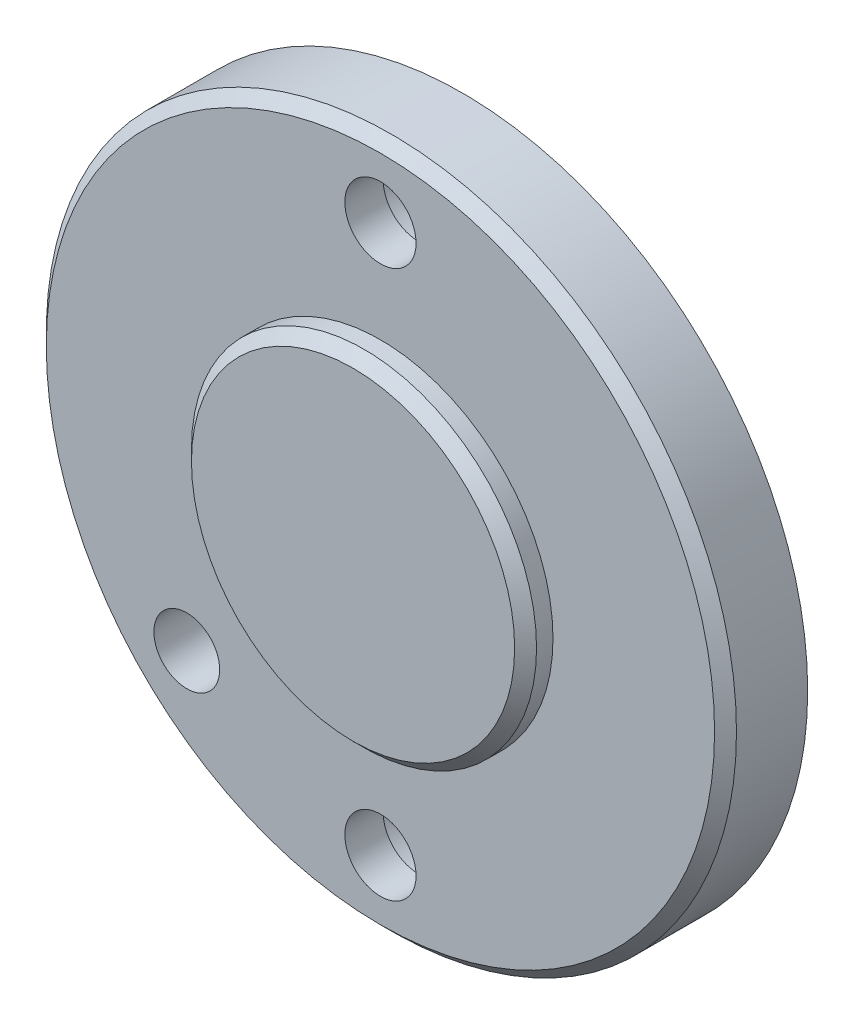
ISO-10303-21;
HEADER;
FILE_DESCRIPTION(('STEP AP214'),'2;1');
FILE_NAME('part.step','',(''),(''),'','','');
FILE_SCHEMA(('AUTOMOTIVE_DESIGN { 1 0 10303 214 1 1 1 1 }'));
ENDSEC;
DATA;
#1=APPLICATION_CONTEXT('core data for automotive mechanical design processes');
#2=APPLICATION_PROTOCOL_DEFINITION('international standard','automotive_design',2000,#1);
#3=PRODUCT_CONTEXT('',#1,'mechanical');
#4=PRODUCT('Part','Part','',(#3));
#5=PRODUCT_RELATED_PRODUCT_CATEGORY('part','',(#4));
#6=PRODUCT_DEFINITION_FORMATION('','',#4);
#7=PRODUCT_DEFINITION_CONTEXT('part definition',#1,'design');
#8=PRODUCT_DEFINITION('design','',#6,#7);
#9=PRODUCT_DEFINITION_SHAPE('','',#8);
#10=(LENGTH_UNIT() NAMED_UNIT(*) SI_UNIT(.MILLI.,.METRE.));
#11=(NAMED_UNIT(*) PLANE_ANGLE_UNIT() SI_UNIT($,.RADIAN.));
#12=(NAMED_UNIT(*) SI_UNIT($,.STERADIAN.) SOLID_ANGLE_UNIT());
#13=UNCERTAINTY_MEASURE_WITH_UNIT(LENGTH_MEASURE(1.E-05),#10,'distance_accuracy_value','');
#14=(GEOMETRIC_REPRESENTATION_CONTEXT(3) GLOBAL_UNCERTAINTY_ASSIGNED_CONTEXT((#13)) GLOBAL_UNIT_ASSIGNED_CONTEXT((#10,
#11,#12)) REPRESENTATION_CONTEXT('',''));
#15=CARTESIAN_POINT('',(0.,0.,0.));
#16=DIRECTION('',(0.,0.,1.));
#17=DIRECTION('',(1.,0.,0.));
#18=AXIS2_PLACEMENT_3D('',#15,#16,#17);
#19=CARTESIAN_POINT('',(0.,0.,-5.));
#20=DIRECTION('',(0.,0.,1.));
#21=DIRECTION('',(1.,0.,0.));
#22=AXIS2_PLACEMENT_3D('',#19,#20,#21);
#23=CYLINDRICAL_SURFACE('',#22,15.75);
#24=CARTESIAN_POINT('',(0.,0.,-5.));
#25=DIRECTION('',(0.,0.,-1.));
#26=DIRECTION('',(-1.,0.,0.));
#27=AXIS2_PLACEMENT_3D('',#24,#25,#26);
#28=CIRCLE('',#27,15.75);
#29=CARTESIAN_POINT('',(-15.75,0.,-5.));
#30=VERTEX_POINT('',#29);
#31=EDGE_CURVE('E76',#30,#30,#28,.T.);
#32=ORIENTED_EDGE('',*,*,#31,.F.);
#33=EDGE_LOOP('',(#32));
#34=FACE_BOUND('',#33,.T.);
#35=CARTESIAN_POINT('',(0.,0.,0.));
#36=DIRECTION('',(0.,0.,1.));
#37=DIRECTION('',(1.,0.,0.));
#38=AXIS2_PLACEMENT_3D('',#35,#36,#37);
#39=CIRCLE('',#38,15.75);
#40=CARTESIAN_POINT('',(15.75,0.,0.));
#41=VERTEX_POINT('',#40);
#42=EDGE_CURVE('E63',#41,#41,#39,.F.);
#43=ORIENTED_EDGE('',*,*,#42,.T.);
#44=EDGE_LOOP('',(#43));
#45=FACE_BOUND('',#44,.T.);
#46=CARTESIAN_POINT('',(0.,15.75,-1.025));
#47=CARTESIAN_POINT('',(0.0826571483601052,15.7499991035098,-1.02500359229986));
#48=CARTESIAN_POINT('',(0.165369597997333,15.7493423907079,-1.03197138826837));
#49=CARTESIAN_POINT('',(0.328503246111101,15.7467857785823,-1.05966315356933));
#50=CARTESIAN_POINT('',(0.408921787236413,15.7448844940345,-1.08040245112928));
#51=CARTESIAN_POINT('',(0.565081525382566,15.7400534533045,-1.13502979919192));
#52=CARTESIAN_POINT('',(0.640825445362738,15.7371243026301,-1.16891010966262));
#53=CARTESIAN_POINT('',(0.785534239159598,15.7305654449096,-1.2488431844416));
#54=CARTESIAN_POINT('',(0.854500497986787,15.7269358814436,-1.29489345470144));
#55=CARTESIAN_POINT('',(0.983932531511118,15.7193701666557,-1.39801659297456));
#56=CARTESIAN_POINT('',(1.0443737704595,15.7154331791069,-1.45512019779767));
#57=CARTESIAN_POINT('',(1.154829310124,15.7077032941751,-1.57866368733053));
#58=CARTESIAN_POINT('',(1.20484313850169,15.7039104033256,-1.64510399474396));
#59=CARTESIAN_POINT('',(1.29310965803656,15.6968894568813,-1.7855866512119));
#60=CARTESIAN_POINT('',(1.33134037911943,15.6936624611898,-1.85964286177298));
#61=CARTESIAN_POINT('',(1.39481515219401,15.6881487680452,-2.01315883308938));
#62=CARTESIAN_POINT('',(1.42005948809152,15.6858620500361,-2.09261847567292));
#63=CARTESIAN_POINT('',(1.45677272439157,15.6824951974023,-2.25443705390308));
#64=CARTESIAN_POINT('',(1.46828206525329,15.6814115212769,-2.33678673954796));
#65=CARTESIAN_POINT('',(1.47732358226487,15.6805623863445,-2.50225559731477));
#66=CARTESIAN_POINT('',(1.47485608345999,15.6807968968817,-2.58537475149706));
#67=CARTESIAN_POINT('',(1.45604733140997,15.6825544098289,-2.74974498830716));
#68=CARTESIAN_POINT('',(1.4397501507136,15.6840733190519,-2.83100116402483));
#69=CARTESIAN_POINT('',(1.39381318594161,15.6882220835359,-2.98961983081341));
#70=CARTESIAN_POINT('',(1.36417324162903,15.6908519521388,-3.06698227511102));
#71=CARTESIAN_POINT('',(1.29234319062757,15.6969310283115,-3.2157571615657));
#72=CARTESIAN_POINT('',(1.25013344207836,15.7003815164881,-3.28716006597813));
#73=CARTESIAN_POINT('',(1.15437609400503,15.7077119292549,-3.42188466453748));
#74=CARTESIAN_POINT('',(1.10082820371016,15.7115918648572,-3.48520615136676));
#75=CARTESIAN_POINT('',(0.983668028070629,15.7193622321385,-3.60222661637762));
#76=CARTESIAN_POINT('',(0.920017664842107,15.723252646468,-3.65588747975337));
#77=CARTESIAN_POINT('',(0.784591814362735,15.7305914195045,-3.75176833522627));
#78=CARTESIAN_POINT('',(0.712816319613766,15.7340397778034,-3.79398831676531));
#79=CARTESIAN_POINT('',(0.563151897609025,15.7401068366299,-3.86578707012577));
#80=CARTESIAN_POINT('',(0.485262084873731,15.7427254167108,-3.89536400696076));
#81=CARTESIAN_POINT('',(0.325592048775548,15.7468365931848,-3.94100965917805));
#82=CARTESIAN_POINT('',(0.243811927476125,15.7483292191003,-3.95707872873719));
#83=CARTESIAN_POINT('',(0.079012906161295,15.7500165189557,-3.97520437900412));
#84=CARTESIAN_POINT('',(-0.00400015901415968,15.7502160665629,-3.97731357571201));
#85=CARTESIAN_POINT('',(-0.169198642524293,15.7493077738885,-3.96759765811979));
#86=CARTESIAN_POINT('',(-0.251384070632599,15.7481999490641,-3.95577270856413));
#87=CARTESIAN_POINT('',(-0.41244321243018,15.7448045653492,-3.91856780006489));
#88=CARTESIAN_POINT('',(-0.491322642904664,15.7425191421983,-3.893212377573));
#89=CARTESIAN_POINT('',(-0.643708145014545,15.7370250907184,-3.82969142360863));
#90=CARTESIAN_POINT('',(-0.717214110277225,15.7338164441196,-3.79152563862674));
#91=CARTESIAN_POINT('',(-0.857004637045904,15.7268230188743,-3.70333616016027));
#92=CARTESIAN_POINT('',(-0.923267231658798,15.72303656681,-3.6532777814134));
#93=CARTESIAN_POINT('',(-1.04646795405064,15.7153180864231,-3.54277397075242));
#94=CARTESIAN_POINT('',(-1.10340587689154,15.7113860549033,-3.48232831060601));
#95=CARTESIAN_POINT('',(-1.2065228007326,15.7038050089881,-3.35253668999644));
#96=CARTESIAN_POINT('',(-1.25266734842523,15.7001569250497,-3.28316329509336));
#97=CARTESIAN_POINT('',(-1.33265104803968,15.6935706140081,-3.13762127299088));
#98=CARTESIAN_POINT('',(-1.36649035018899,15.690632378239,-3.06145272876358));
#99=CARTESIAN_POINT('',(-1.42084489925281,15.6858040381628,-2.90460225130565));
#100=CARTESIAN_POINT('',(-1.44138088316584,15.6839123032625,-2.82392755648324));
#101=CARTESIAN_POINT('',(-1.46861323381282,15.6813859457834,-2.66025653987748));
#102=CARTESIAN_POINT('',(-1.47530994444978,15.6807512919664,-2.57726027583658));
#103=CARTESIAN_POINT('',(-1.47466920747502,15.6808115359026,-2.41164449410185));
#104=CARTESIAN_POINT('',(-1.46738588525625,15.6815013059914,-2.32902475978614));
#105=CARTESIAN_POINT('',(-1.4391050646026,15.6841217608103,-2.16618780139515));
#106=CARTESIAN_POINT('',(-1.41810754835,15.6860524471525,-2.0859705804414));
#107=CARTESIAN_POINT('',(-1.36300883921194,15.6909358028365,-1.93021457984005));
#108=CARTESIAN_POINT('',(-1.32890899535255,15.6938883669618,-1.85467531947535));
#109=CARTESIAN_POINT('',(-1.24857933722215,15.7004830060454,-1.71038430007716));
#110=CARTESIAN_POINT('',(-1.20234963990488,15.7041250743555,-1.64163247560931));
#111=CARTESIAN_POINT('',(-1.09886909936237,15.711705207446,-1.51259061219349));
#112=CARTESIAN_POINT('',(-1.04157799434058,15.7156443204866,-1.45233292088949));
#113=CARTESIAN_POINT('',(-0.917678522322408,15.7233651088524,-1.3422614697405));
#114=CARTESIAN_POINT('',(-0.851067918012397,15.727146746089,-1.29245022495002));
#115=CARTESIAN_POINT('',(-0.710259293481323,15.7341351309695,-1.20460003816502));
#116=CARTESIAN_POINT('',(-0.636044535873988,15.7373405657305,-1.16658784082245));
#117=CARTESIAN_POINT('',(-0.48230439529333,15.7428007256491,-1.10361442053741));
#118=CARTESIAN_POINT('',(-0.402785163711928,15.7450565305927,-1.07863836692232));
#119=CARTESIAN_POINT('',(-0.269006675153423,15.7477914937434,-1.04872772354005));
#120=CARTESIAN_POINT('',(-0.2156047519297,15.7486158586512,-1.0398418508608));
#121=CARTESIAN_POINT('',(-0.108143109486163,15.7497204041159,-1.02797682421591));
#122=CARTESIAN_POINT('',(-0.0540833925753423,15.7500005865824,-1.02499764952255));
#123=CARTESIAN_POINT('',(0.,15.75,-1.025));
#124=B_SPLINE_CURVE_WITH_KNOTS('',3,(#46,#47,#48,#49,#50,#51,#52,#53,#54,#55,#56,#57,#58,#59,
#60,#61,#62,#63,#64,#65,#66,#67,#68,#69,#70,#71,#72,#73,#74,#75,#76,#77,#78,#79,#80,#81,#82,#83,
#84,#85,#86,#87,#88,#89,#90,#91,#92,#93,#94,#95,#96,#97,#98,#99,#100,#101,#102,#103,#104,#105,
#106,#107,#108,#109,#110,#111,#112,#113,#114,#115,#116,#117,#118,#119,#120,#121,#122,#123),
.UNSPECIFIED.,.T.,.F.,(4,2,2,2,2,2,2,2,2,2,2,2,2,2,2,2,2,2,2,2,2,2,2,2,2,2,2,2,2,2,2,2,2,2,2,2,
2,2,4),(0.,0.247773964473802,0.495824174499337,0.74372850473767,0.991582070092005,
1.2401350268247,1.48869924000682,1.73772414585759,1.98674360734368,2.23502804816671,
2.48330671491258,2.73079712362453,2.97829050459715,3.2261726719988,3.47406119719827,
3.72290726975589,3.97175357195808,4.22063597896605,4.46951186006317,4.71744916904945,
4.96538354668404,5.21286983508894,5.46036102138808,5.70858308473555,5.95681060278657,
6.20581998699695,6.45482633109679,6.70344358813377,6.95205466701006,7.19970515907194,
7.44735597288635,7.69498129520573,7.94260423005677,8.1911460699032,8.43974767940291,
8.68890874201917,8.93778572330758,9.09990725642934,9.26202822063445),.UNSPECIFIED.);
#125=CARTESIAN_POINT('',(0.,15.75,-1.025));
#126=VERTEX_POINT('',#125);
#127=EDGE_CURVE('E77',#126,#126,#124,.T.);
#128=ORIENTED_EDGE('',*,*,#127,.F.);
#129=EDGE_LOOP('',(#128));
#130=FACE_BOUND('',#129,.T.);
#131=CARTESIAN_POINT('',(0.,-15.75,-1.025));
#132=CARTESIAN_POINT('',(-0.0826571483601052,-15.7499991035098,-1.02500359229986));
#133=CARTESIAN_POINT('',(-0.165369597997333,-15.7493423907079,-1.03197138826837));
#134=CARTESIAN_POINT('',(-0.328503246111101,-15.7467857785823,-1.05966315356933));
#135=CARTESIAN_POINT('',(-0.408921787236413,-15.7448844940345,-1.08040245112928));
#136=CARTESIAN_POINT('',(-0.565081525382566,-15.7400534533045,-1.13502979919192));
#137=CARTESIAN_POINT('',(-0.640825445362738,-15.7371243026301,-1.16891010966262));
#138=CARTESIAN_POINT('',(-0.785534239159598,-15.7305654449096,-1.2488431844416));
#139=CARTESIAN_POINT('',(-0.854500497986787,-15.7269358814436,-1.29489345470144));
#140=CARTESIAN_POINT('',(-0.983932531511118,-15.7193701666557,-1.39801659297456));
#141=CARTESIAN_POINT('',(-1.0443737704595,-15.7154331791069,-1.45512019779767));
#142=CARTESIAN_POINT('',(-1.154829310124,-15.7077032941751,-1.57866368733053));
#143=CARTESIAN_POINT('',(-1.20484313850169,-15.7039104033256,-1.64510399474396));
#144=CARTESIAN_POINT('',(-1.29310965803656,-15.6968894568813,-1.7855866512119));
#145=CARTESIAN_POINT('',(-1.33134037911943,-15.6936624611898,-1.85964286177298));
#146=CARTESIAN_POINT('',(-1.39481515219401,-15.6881487680452,-2.01315883308938));
#147=CARTESIAN_POINT('',(-1.42005948809152,-15.6858620500361,-2.09261847567292));
#148=CARTESIAN_POINT('',(-1.45677272439157,-15.6824951974023,-2.25443705390308));
#149=CARTESIAN_POINT('',(-1.46828206525329,-15.6814115212769,-2.33678673954796));
#150=CARTESIAN_POINT('',(-1.47732358226487,-15.6805623863445,-2.50225559731477));
#151=CARTESIAN_POINT('',(-1.47485608345999,-15.6807968968817,-2.58537475149706));
#152=CARTESIAN_POINT('',(-1.45604733140997,-15.6825544098289,-2.74974498830716));
#153=CARTESIAN_POINT('',(-1.4397501507136,-15.6840733190519,-2.83100116402483));
#154=CARTESIAN_POINT('',(-1.39381318594161,-15.6882220835359,-2.98961983081341));
#155=CARTESIAN_POINT('',(-1.36417324162903,-15.6908519521388,-3.06698227511102));
#156=CARTESIAN_POINT('',(-1.29234319062757,-15.6969310283115,-3.2157571615657));
#157=CARTESIAN_POINT('',(-1.25013344207836,-15.7003815164881,-3.28716006597813));
#158=CARTESIAN_POINT('',(-1.15437609400503,-15.7077119292549,-3.42188466453748));
#159=CARTESIAN_POINT('',(-1.10082820371016,-15.7115918648572,-3.48520615136676));
#160=CARTESIAN_POINT('',(-0.983668028070629,-15.7193622321385,-3.60222661637762));
#161=CARTESIAN_POINT('',(-0.920017664842107,-15.723252646468,-3.65588747975337));
#162=CARTESIAN_POINT('',(-0.784591814362735,-15.7305914195045,-3.75176833522627));
#163=CARTESIAN_POINT('',(-0.712816319613766,-15.7340397778034,-3.79398831676531));
#164=CARTESIAN_POINT('',(-0.563151897609025,-15.7401068366299,-3.86578707012577));
#165=CARTESIAN_POINT('',(-0.485262084873731,-15.7427254167108,-3.89536400696076));
#166=CARTESIAN_POINT('',(-0.325592048775548,-15.7468365931848,-3.94100965917805));
#167=CARTESIAN_POINT('',(-0.243811927476125,-15.7483292191003,-3.95707872873719));
#168=CARTESIAN_POINT('',(-0.079012906161295,-15.7500165189557,-3.97520437900412));
#169=CARTESIAN_POINT('',(0.00400015901415968,-15.7502160665629,-3.97731357571201));
#170=CARTESIAN_POINT('',(0.169198642524293,-15.7493077738885,-3.96759765811979));
#171=CARTESIAN_POINT('',(0.251384070632599,-15.7481999490641,-3.95577270856413));
#172=CARTESIAN_POINT('',(0.41244321243018,-15.7448045653492,-3.91856780006489));
#173=CARTESIAN_POINT('',(0.491322642904664,-15.7425191421983,-3.893212377573));
#174=CARTESIAN_POINT('',(0.643708145014545,-15.7370250907184,-3.82969142360863));
#175=CARTESIAN_POINT('',(0.717214110277225,-15.7338164441196,-3.79152563862674));
#176=CARTESIAN_POINT('',(0.857004637045904,-15.7268230188743,-3.70333616016027));
#177=CARTESIAN_POINT('',(0.923267231658798,-15.72303656681,-3.6532777814134));
#178=CARTESIAN_POINT('',(1.04646795405064,-15.7153180864231,-3.54277397075242));
#179=CARTESIAN_POINT('',(1.10340587689154,-15.7113860549033,-3.48232831060601));
#180=CARTESIAN_POINT('',(1.2065228007326,-15.7038050089881,-3.35253668999644));
#181=CARTESIAN_POINT('',(1.25266734842523,-15.7001569250497,-3.28316329509336));
#182=CARTESIAN_POINT('',(1.33265104803968,-15.6935706140081,-3.13762127299088));
#183=CARTESIAN_POINT('',(1.36649035018899,-15.690632378239,-3.06145272876358));
#184=CARTESIAN_POINT('',(1.42084489925281,-15.6858040381628,-2.90460225130565));
#185=CARTESIAN_POINT('',(1.44138088316584,-15.6839123032625,-2.82392755648324));
#186=CARTESIAN_POINT('',(1.46861323381282,-15.6813859457834,-2.66025653987748));
#187=CARTESIAN_POINT('',(1.47530994444978,-15.6807512919664,-2.57726027583658));
#188=CARTESIAN_POINT('',(1.47466920747502,-15.6808115359026,-2.41164449410185));
#189=CARTESIAN_POINT('',(1.46738588525625,-15.6815013059914,-2.32902475978614));
#190=CARTESIAN_POINT('',(1.4391050646026,-15.6841217608103,-2.16618780139515));
#191=CARTESIAN_POINT('',(1.41810754835,-15.6860524471525,-2.0859705804414));
#192=CARTESIAN_POINT('',(1.36300883921194,-15.6909358028365,-1.93021457984005));
#193=CARTESIAN_POINT('',(1.32890899535255,-15.6938883669618,-1.85467531947535));
#194=CARTESIAN_POINT('',(1.24857933722215,-15.7004830060454,-1.71038430007716));
#195=CARTESIAN_POINT('',(1.20234963990488,-15.7041250743555,-1.64163247560931));
#196=CARTESIAN_POINT('',(1.09886909936237,-15.711705207446,-1.51259061219349));
#197=CARTESIAN_POINT('',(1.04157799434058,-15.7156443204866,-1.45233292088949));
#198=CARTESIAN_POINT('',(0.917678522322408,-15.7233651088524,-1.3422614697405));
#199=CARTESIAN_POINT('',(0.851067918012397,-15.727146746089,-1.29245022495002));
#200=CARTESIAN_POINT('',(0.710259293481323,-15.7341351309695,-1.20460003816502));
#201=CARTESIAN_POINT('',(0.636044535873988,-15.7373405657305,-1.16658784082245));
#202=CARTESIAN_POINT('',(0.48230439529333,-15.7428007256491,-1.10361442053741));
#203=CARTESIAN_POINT('',(0.402785163711928,-15.7450565305927,-1.07863836692232));
#204=CARTESIAN_POINT('',(0.269006675153423,-15.7477914937434,-1.04872772354005));
#205=CARTESIAN_POINT('',(0.2156047519297,-15.7486158586512,-1.0398418508608));
#206=CARTESIAN_POINT('',(0.108143109486163,-15.7497204041159,-1.02797682421591));
#207=CARTESIAN_POINT('',(0.0540833925753423,-15.7500005865824,-1.02499764952255));
#208=CARTESIAN_POINT('',(0.,-15.75,-1.025));
#209=B_SPLINE_CURVE_WITH_KNOTS('',3,(#131,#132,#133,#134,#135,#136,#137,#138,#139,#140,#141,
#142,#143,#144,#145,#146,#147,#148,#149,#150,#151,#152,#153,#154,#155,#156,#157,#158,#159,#160,
#161,#162,#163,#164,#165,#166,#167,#168,#169,#170,#171,#172,#173,#174,#175,#176,#177,#178,#179,
#180,#181,#182,#183,#184,#185,#186,#187,#188,#189,#190,#191,#192,#193,#194,#195,#196,#197,#198,
#199,#200,#201,#202,#203,#204,#205,#206,#207,#208),.UNSPECIFIED.,.T.,.F.,(4,2,2,2,2,2,2,2,2,2,2,
2,2,2,2,2,2,2,2,2,2,2,2,2,2,2,2,2,2,2,2,2,2,2,2,2,2,2,4),(0.,0.247773964473802,
0.495824174499337,0.74372850473767,0.991582070092005,1.2401350268247,1.48869924000682,
1.73772414585759,1.98674360734368,2.23502804816671,2.48330671491258,2.73079712362453,
2.97829050459715,3.2261726719988,3.47406119719827,3.72290726975589,3.97175357195808,
4.22063597896605,4.46951186006317,4.71744916904945,4.96538354668404,5.21286983508894,
5.46036102138808,5.70858308473555,5.95681060278657,6.20581998699695,6.45482633109679,
6.70344358813377,6.95205466701006,7.19970515907194,7.44735597288635,7.69498129520573,
7.94260423005677,8.1911460699032,8.43974767940291,8.68890874201917,8.93778572330758,
9.09990725642934,9.26202822063445),.UNSPECIFIED.);
#210=CARTESIAN_POINT('',(0.,-15.75,-1.025));
#211=VERTEX_POINT('',#210);
#212=EDGE_CURVE('E68',#211,#211,#209,.T.);
#213=ORIENTED_EDGE('',*,*,#212,.F.);
#214=EDGE_LOOP('',(#213));
#215=FACE_BOUND('',#214,.T.);
#216=CARTESIAN_POINT('',(-15.75,0.,-3.975));
#217=CARTESIAN_POINT('',(-15.7499991035098,-0.0826571483601052,-3.97499640770014));
#218=CARTESIAN_POINT('',(-15.7493423907079,-0.165369597997333,-3.96802861173163));
#219=CARTESIAN_POINT('',(-15.7467857785823,-0.328503246111101,-3.94033684643067));
#220=CARTESIAN_POINT('',(-15.7448844940345,-0.408921787236413,-3.91959754887072));
#221=CARTESIAN_POINT('',(-15.7400534533045,-0.565081525382566,-3.86497020080808));
#222=CARTESIAN_POINT('',(-15.7371243026301,-0.640825445362739,-3.83108989033738));
#223=CARTESIAN_POINT('',(-15.7305654449096,-0.785534239159598,-3.7511568155584));
#224=CARTESIAN_POINT('',(-15.7269358814436,-0.854500497986787,-3.70510654529856));
#225=CARTESIAN_POINT('',(-15.7193701666557,-0.983932531511118,-3.60198340702544));
#226=CARTESIAN_POINT('',(-15.7154331791069,-1.0443737704595,-3.54487980220233));
#227=CARTESIAN_POINT('',(-15.7077032941751,-1.154829310124,-3.42133631266947));
#228=CARTESIAN_POINT('',(-15.7039104033256,-1.20484313850169,-3.35489600525604));
#229=CARTESIAN_POINT('',(-15.6968894568813,-1.29310965803656,-3.2144133487881));
#230=CARTESIAN_POINT('',(-15.6936624611898,-1.33134037911943,-3.14035713822702));
#231=CARTESIAN_POINT('',(-15.6881487680452,-1.39481515219401,-2.98684116691062));
#232=CARTESIAN_POINT('',(-15.6858620500361,-1.42005948809152,-2.90738152432708));
#233=CARTESIAN_POINT('',(-15.6824951974023,-1.45677272439157,-2.74556294609692));
#234=CARTESIAN_POINT('',(-15.6814115212769,-1.46828206525329,-2.66321326045204));
#235=CARTESIAN_POINT('',(-15.6805623863445,-1.47732358226487,-2.49774440268523));
#236=CARTESIAN_POINT('',(-15.6807968968817,-1.47485608345999,-2.41462524850294));
#237=CARTESIAN_POINT('',(-15.6825544098289,-1.45604733140997,-2.25025501169284));
#238=CARTESIAN_POINT('',(-15.6840733190519,-1.4397501507136,-2.16899883597517));
#239=CARTESIAN_POINT('',(-15.6882220835359,-1.39381318594161,-2.01038016918659));
#240=CARTESIAN_POINT('',(-15.6908519521388,-1.36417324162903,-1.93301772488898));
#241=CARTESIAN_POINT('',(-15.6969310283115,-1.29234319062757,-1.78424283843431));
#242=CARTESIAN_POINT('',(-15.7003815164881,-1.25013344207836,-1.71283993402187));
#243=CARTESIAN_POINT('',(-15.7077119292549,-1.15437609400503,-1.57811533546252));
#244=CARTESIAN_POINT('',(-15.7115918648572,-1.10082820371016,-1.51479384863324));
#245=CARTESIAN_POINT('',(-15.7193622321385,-0.983668028070629,-1.39777338362238));
#246=CARTESIAN_POINT('',(-15.723252646468,-0.920017664842108,-1.34411252024663));
#247=CARTESIAN_POINT('',(-15.7305914195045,-0.784591814362735,-1.24823166477373));
#248=CARTESIAN_POINT('',(-15.7340397778034,-0.712816319613767,-1.20601168323469));
#249=CARTESIAN_POINT('',(-15.7401068366299,-0.563151897609025,-1.13421292987423));
#250=CARTESIAN_POINT('',(-15.7427254167108,-0.485262084873732,-1.10463599303924));
#251=CARTESIAN_POINT('',(-15.7468365931848,-0.325592048775549,-1.05899034082195));
#252=CARTESIAN_POINT('',(-15.7483292191003,-0.243811927476126,-1.04292127126281));
#253=CARTESIAN_POINT('',(-15.7500165189557,-0.0790129061612955,-1.02479562099588));
#254=CARTESIAN_POINT('',(-15.7502160665629,0.00400015901415926,-1.02268642428799));
#255=CARTESIAN_POINT('',(-15.7493077738885,0.169198642524293,-1.03240234188021));
#256=CARTESIAN_POINT('',(-15.7481999490641,0.251384070632599,-1.04422729143587));
#257=CARTESIAN_POINT('',(-15.7448045653492,0.41244321243018,-1.08143219993511));
#258=CARTESIAN_POINT('',(-15.7425191421983,0.491322642904663,-1.106787622427));
#259=CARTESIAN_POINT('',(-15.7370250907184,0.643708145014545,-1.17030857639137));
#260=CARTESIAN_POINT('',(-15.7338164441196,0.717214110277225,-1.20847436137326));
#261=CARTESIAN_POINT('',(-15.7268230188743,0.857004637045904,-1.29666383983973));
#262=CARTESIAN_POINT('',(-15.72303656681,0.923267231658798,-1.3467222185866));
#263=CARTESIAN_POINT('',(-15.7153180864231,1.04646795405064,-1.45722602924758));
#264=CARTESIAN_POINT('',(-15.7113860549033,1.10340587689154,-1.51767168939399));
#265=CARTESIAN_POINT('',(-15.7038050089881,1.2065228007326,-1.64746331000356));
#266=CARTESIAN_POINT('',(-15.7001569250497,1.25266734842523,-1.71683670490664));
#267=CARTESIAN_POINT('',(-15.6935706140081,1.33265104803968,-1.86237872700912));
#268=CARTESIAN_POINT('',(-15.690632378239,1.36649035018899,-1.93854727123642));
#269=CARTESIAN_POINT('',(-15.6858040381628,1.42084489925281,-2.09539774869435));
#270=CARTESIAN_POINT('',(-15.6839123032625,1.44138088316584,-2.17607244351676));
#271=CARTESIAN_POINT('',(-15.6813859457834,1.46861323381282,-2.33974346012252));
#272=CARTESIAN_POINT('',(-15.6807512919664,1.47530994444978,-2.42273972416342));
#273=CARTESIAN_POINT('',(-15.6808115359026,1.47466920747502,-2.58835550589815));
#274=CARTESIAN_POINT('',(-15.6815013059914,1.46738588525625,-2.67097524021386));
#275=CARTESIAN_POINT('',(-15.6841217608103,1.4391050646026,-2.83381219860485));
#276=CARTESIAN_POINT('',(-15.6860524471525,1.41810754835,-2.9140294195586));
#277=CARTESIAN_POINT('',(-15.6909358028365,1.36300883921194,-3.06978542015995));
#278=CARTESIAN_POINT('',(-15.6938883669618,1.32890899535255,-3.14532468052465));
#279=CARTESIAN_POINT('',(-15.7004830060454,1.24857933722215,-3.28961569992284));
#280=CARTESIAN_POINT('',(-15.7041250743555,1.20234963990488,-3.35836752439069));
#281=CARTESIAN_POINT('',(-15.711705207446,1.09886909936237,-3.48740938780651));
#282=CARTESIAN_POINT('',(-15.7156443204866,1.04157799434058,-3.54766707911051));
#283=CARTESIAN_POINT('',(-15.7233651088524,0.917678522322408,-3.6577385302595));
#284=CARTESIAN_POINT('',(-15.727146746089,0.851067918012397,-3.70754977504998));
#285=CARTESIAN_POINT('',(-15.7341351309695,0.710259293481323,-3.79539996183498));
#286=CARTESIAN_POINT('',(-15.7373405657305,0.636044535873988,-3.83341215917755));
#287=CARTESIAN_POINT('',(-15.7428007256491,0.48230439529333,-3.89638557946259));
#288=CARTESIAN_POINT('',(-15.7450565305927,0.402785163711928,-3.92136163307768));
#289=CARTESIAN_POINT('',(-15.7477914937434,0.269006675153423,-3.95127227645995));
#290=CARTESIAN_POINT('',(-15.7486158586512,0.2156047519297,-3.9601581491392));
#291=CARTESIAN_POINT('',(-15.7497204041159,0.108143109486163,-3.97202317578409));
#292=CARTESIAN_POINT('',(-15.7500005865824,0.0540833925753423,-3.97500235047746));
#293=CARTESIAN_POINT('',(-15.75,0.,-3.975));
#294=B_SPLINE_CURVE_WITH_KNOTS('',3,(#216,#217,#218,#219,#220,#221,#222,#223,#224,#225,#226,
#227,#228,#229,#230,#231,#232,#233,#234,#235,#236,#237,#238,#239,#240,#241,#242,#243,#244,#245,
#246,#247,#248,#249,#250,#251,#252,#253,#254,#255,#256,#257,#258,#259,#260,#261,#262,#263,#264,
#265,#266,#267,#268,#269,#270,#271,#272,#273,#274,#275,#276,#277,#278,#279,#280,#281,#282,#283,
#284,#285,#286,#287,#288,#289,#290,#291,#292,#293),.UNSPECIFIED.,.T.,.F.,(4,2,2,2,2,2,2,2,2,2,2,
2,2,2,2,2,2,2,2,2,2,2,2,2,2,2,2,2,2,2,2,2,2,2,2,2,2,2,4),(0.,0.247773964473802,
0.495824174499337,0.74372850473767,0.991582070092005,1.2401350268247,1.48869924000682,
1.73772414585759,1.98674360734368,2.23502804816671,2.48330671491258,2.73079712362453,
2.97829050459715,3.2261726719988,3.47406119719827,3.72290726975589,3.97175357195808,
4.22063597896605,4.46951186006317,4.71744916904945,4.96538354668404,5.21286983508894,
5.46036102138808,5.70858308473555,5.95681060278657,6.20581998699695,6.45482633109679,
6.70344358813377,6.95205466701006,7.19970515907194,7.44735597288635,7.69498129520573,
7.94260423005677,8.1911460699032,8.4397476794029,8.68890874201917,8.93778572330758,
9.09990725642934,9.26202822063445),.UNSPECIFIED.);
#295=CARTESIAN_POINT('',(-15.75,0.,-3.975));
#296=VERTEX_POINT('',#295);
#297=EDGE_CURVE('E120',#296,#296,#294,.T.);
#298=ORIENTED_EDGE('',*,*,#297,.F.);
#299=EDGE_LOOP('',(#298));
#300=FACE_BOUND('',#299,.T.);
#301=CARTESIAN_POINT('',(15.75,0.,-3.975));
#302=CARTESIAN_POINT('',(15.7499991035098,0.0826571483601052,-3.97499640770014));
#303=CARTESIAN_POINT('',(15.7493423907079,0.165369597997333,-3.96802861173163));
#304=CARTESIAN_POINT('',(15.7467857785823,0.328503246111101,-3.94033684643067));
#305=CARTESIAN_POINT('',(15.7448844940345,0.408921787236413,-3.91959754887072));
#306=CARTESIAN_POINT('',(15.7400534533045,0.565081525382566,-3.86497020080808));
#307=CARTESIAN_POINT('',(15.7371243026301,0.640825445362739,-3.83108989033738));
#308=CARTESIAN_POINT('',(15.7305654449096,0.785534239159598,-3.7511568155584));
#309=CARTESIAN_POINT('',(15.7269358814436,0.854500497986787,-3.70510654529856));
#310=CARTESIAN_POINT('',(15.7193701666557,0.983932531511118,-3.60198340702544));
#311=CARTESIAN_POINT('',(15.7154331791069,1.0443737704595,-3.54487980220233));
#312=CARTESIAN_POINT('',(15.7077032941751,1.154829310124,-3.42133631266947));
#313=CARTESIAN_POINT('',(15.7039104033256,1.20484313850169,-3.35489600525604));
#314=CARTESIAN_POINT('',(15.6968894568813,1.29310965803656,-3.2144133487881));
#315=CARTESIAN_POINT('',(15.6936624611898,1.33134037911943,-3.14035713822702));
#316=CARTESIAN_POINT('',(15.6881487680452,1.39481515219401,-2.98684116691062));
#317=CARTESIAN_POINT('',(15.6858620500361,1.42005948809152,-2.90738152432708));
#318=CARTESIAN_POINT('',(15.6824951974023,1.45677272439157,-2.74556294609692));
#319=CARTESIAN_POINT('',(15.6814115212769,1.46828206525329,-2.66321326045204));
#320=CARTESIAN_POINT('',(15.6805623863445,1.47732358226487,-2.49774440268523));
#321=CARTESIAN_POINT('',(15.6807968968817,1.47485608345999,-2.41462524850294));
#322=CARTESIAN_POINT('',(15.6825544098289,1.45604733140997,-2.25025501169284));
#323=CARTESIAN_POINT('',(15.6840733190519,1.4397501507136,-2.16899883597517));
#324=CARTESIAN_POINT('',(15.6882220835359,1.39381318594161,-2.01038016918659));
#325=CARTESIAN_POINT('',(15.6908519521388,1.36417324162903,-1.93301772488898));
#326=CARTESIAN_POINT('',(15.6969310283115,1.29234319062757,-1.78424283843431));
#327=CARTESIAN_POINT('',(15.7003815164881,1.25013344207836,-1.71283993402187));
#328=CARTESIAN_POINT('',(15.7077119292549,1.15437609400503,-1.57811533546252));
#329=CARTESIAN_POINT('',(15.7115918648572,1.10082820371016,-1.51479384863324));
#330=CARTESIAN_POINT('',(15.7193622321385,0.983668028070629,-1.39777338362238));
#331=CARTESIAN_POINT('',(15.723252646468,0.920017664842108,-1.34411252024663));
#332=CARTESIAN_POINT('',(15.7305914195045,0.784591814362735,-1.24823166477373));
#333=CARTESIAN_POINT('',(15.7340397778034,0.712816319613767,-1.20601168323469));
#334=CARTESIAN_POINT('',(15.7401068366299,0.563151897609025,-1.13421292987423));
#335=CARTESIAN_POINT('',(15.7427254167108,0.485262084873732,-1.10463599303924));
#336=CARTESIAN_POINT('',(15.7468365931848,0.325592048775549,-1.05899034082195));
#337=CARTESIAN_POINT('',(15.7483292191003,0.243811927476126,-1.04292127126281));
#338=CARTESIAN_POINT('',(15.7500165189557,0.0790129061612955,-1.02479562099588));
#339=CARTESIAN_POINT('',(15.7502160665629,-0.00400015901415926,-1.02268642428799));
#340=CARTESIAN_POINT('',(15.7493077738885,-0.169198642524293,-1.03240234188021));
#341=CARTESIAN_POINT('',(15.7481999490641,-0.251384070632599,-1.04422729143587));
#342=CARTESIAN_POINT('',(15.7448045653492,-0.41244321243018,-1.08143219993511));
#343=CARTESIAN_POINT('',(15.7425191421983,-0.491322642904663,-1.106787622427));
#344=CARTESIAN_POINT('',(15.7370250907184,-0.643708145014545,-1.17030857639137));
#345=CARTESIAN_POINT('',(15.7338164441196,-0.717214110277225,-1.20847436137326));
#346=CARTESIAN_POINT('',(15.7268230188743,-0.857004637045904,-1.29666383983973));
#347=CARTESIAN_POINT('',(15.72303656681,-0.923267231658798,-1.3467222185866));
#348=CARTESIAN_POINT('',(15.7153180864231,-1.04646795405064,-1.45722602924758));
#349=CARTESIAN_POINT('',(15.7113860549033,-1.10340587689154,-1.51767168939399));
#350=CARTESIAN_POINT('',(15.7038050089881,-1.2065228007326,-1.64746331000356));
#351=CARTESIAN_POINT('',(15.7001569250497,-1.25266734842523,-1.71683670490664));
#352=CARTESIAN_POINT('',(15.6935706140081,-1.33265104803968,-1.86237872700912));
#353=CARTESIAN_POINT('',(15.690632378239,-1.36649035018899,-1.93854727123642));
#354=CARTESIAN_POINT('',(15.6858040381628,-1.42084489925281,-2.09539774869435));
#355=CARTESIAN_POINT('',(15.6839123032625,-1.44138088316584,-2.17607244351676));
#356=CARTESIAN_POINT('',(15.6813859457834,-1.46861323381282,-2.33974346012252));
#357=CARTESIAN_POINT('',(15.6807512919664,-1.47530994444978,-2.42273972416342));
#358=CARTESIAN_POINT('',(15.6808115359026,-1.47466920747502,-2.58835550589815));
#359=CARTESIAN_POINT('',(15.6815013059914,-1.46738588525625,-2.67097524021386));
#360=CARTESIAN_POINT('',(15.6841217608103,-1.4391050646026,-2.83381219860485));
#361=CARTESIAN_POINT('',(15.6860524471525,-1.41810754835,-2.9140294195586));
#362=CARTESIAN_POINT('',(15.6909358028365,-1.36300883921194,-3.06978542015995));
#363=CARTESIAN_POINT('',(15.6938883669618,-1.32890899535255,-3.14532468052465));
#364=CARTESIAN_POINT('',(15.7004830060454,-1.24857933722215,-3.28961569992284));
#365=CARTESIAN_POINT('',(15.7041250743555,-1.20234963990488,-3.35836752439069));
#366=CARTESIAN_POINT('',(15.711705207446,-1.09886909936237,-3.48740938780651));
#367=CARTESIAN_POINT('',(15.7156443204866,-1.04157799434058,-3.54766707911051));
#368=CARTESIAN_POINT('',(15.7233651088524,-0.917678522322408,-3.6577385302595));
#369=CARTESIAN_POINT('',(15.727146746089,-0.851067918012397,-3.70754977504998));
#370=CARTESIAN_POINT('',(15.7341351309695,-0.710259293481323,-3.79539996183498));
#371=CARTESIAN_POINT('',(15.7373405657305,-0.636044535873988,-3.83341215917755));
#372=CARTESIAN_POINT('',(15.7428007256491,-0.48230439529333,-3.89638557946259));
#373=CARTESIAN_POINT('',(15.7450565305927,-0.402785163711928,-3.92136163307768));
#374=CARTESIAN_POINT('',(15.7477914937434,-0.269006675153423,-3.95127227645995));
#375=CARTESIAN_POINT('',(15.7486158586512,-0.2156047519297,-3.9601581491392));
#376=CARTESIAN_POINT('',(15.7497204041159,-0.108143109486163,-3.97202317578409));
#377=CARTESIAN_POINT('',(15.7500005865824,-0.0540833925753423,-3.97500235047746));
#378=CARTESIAN_POINT('',(15.75,0.,-3.975));
#379=B_SPLINE_CURVE_WITH_KNOTS('',3,(#301,#302,#303,#304,#305,#306,#307,#308,#309,#310,#311,
#312,#313,#314,#315,#316,#317,#318,#319,#320,#321,#322,#323,#324,#325,#326,#327,#328,#329,#330,
#331,#332,#333,#334,#335,#336,#337,#338,#339,#340,#341,#342,#343,#344,#345,#346,#347,#348,#349,
#350,#351,#352,#353,#354,#355,#356,#357,#358,#359,#360,#361,#362,#363,#364,#365,#366,#367,#368,
#369,#370,#371,#372,#373,#374,#375,#376,#377,#378),.UNSPECIFIED.,.T.,.F.,(4,2,2,2,2,2,2,2,2,2,2,
2,2,2,2,2,2,2,2,2,2,2,2,2,2,2,2,2,2,2,2,2,2,2,2,2,2,2,4),(0.,0.247773964473802,
0.495824174499337,0.74372850473767,0.991582070092005,1.2401350268247,1.48869924000682,
1.73772414585759,1.98674360734368,2.23502804816671,2.48330671491258,2.73079712362453,
2.97829050459715,3.2261726719988,3.47406119719827,3.72290726975589,3.97175357195808,
4.22063597896605,4.46951186006317,4.71744916904945,4.96538354668404,5.21286983508894,
5.46036102138808,5.70858308473555,5.95681060278657,6.20581998699695,6.45482633109679,
6.70344358813377,6.95205466701006,7.19970515907194,7.44735597288635,7.69498129520573,
7.94260423005677,8.1911460699032,8.4397476794029,8.68890874201917,8.93778572330758,
9.09990725642934,9.26202822063445),.UNSPECIFIED.);
#380=CARTESIAN_POINT('',(15.75,0.,-3.975));
#381=VERTEX_POINT('',#380);
#382=EDGE_CURVE('E123',#381,#381,#379,.T.);
#383=ORIENTED_EDGE('',*,*,#382,.F.);
#384=EDGE_LOOP('',(#383));
#385=FACE_BOUND('',#384,.T.);
#386=ADVANCED_FACE('F34',(#34,#45,#130,#215,#300,#385),#23,.T.);
#387=CARTESIAN_POINT('',(0.,17.3385295260296,-2.5));
#388=DIRECTION('',(0.,1.,0.));
#389=DIRECTION('',(0.,0.,1.));
#390=AXIS2_PLACEMENT_3D('',#387,#388,#389);
#391=CYLINDRICAL_SURFACE('',#390,1.475);
#392=ORIENTED_EDGE('',*,*,#127,.T.);
#393=EDGE_LOOP('',(#392));
#394=FACE_BOUND('',#393,.T.);
#395=CARTESIAN_POINT('',(0.,0.,-2.5));
#396=DIRECTION('',(-0.707106781186547,0.707106781186547,0.));
#397=DIRECTION('',(0.707106781186547,0.707106781186547,0.));
#398=AXIS2_PLACEMENT_3D('',#395,#396,#397);
#399=ELLIPSE('',#398,2.08596500450032,1.475);
#400=CARTESIAN_POINT('',(0.,0.,-3.975));
#401=VERTEX_POINT('',#400);
#402=CARTESIAN_POINT('',(0.,0.,-1.025));
#403=VERTEX_POINT('',#402);
#404=EDGE_CURVE('E48',#401,#403,#399,.F.);
#405=ORIENTED_EDGE('',*,*,#404,.T.);
#406=CARTESIAN_POINT('',(0.,0.,-2.5));
#407=DIRECTION('',(0.707106781186547,0.707106781186547,0.));
#408=DIRECTION('',(-0.707106781186547,0.707106781186547,0.));
#409=AXIS2_PLACEMENT_3D('',#406,#407,#408);
#410=ELLIPSE('',#409,2.08596500450032,1.475);
#411=EDGE_CURVE('E11',#403,#401,#410,.F.);
#412=ORIENTED_EDGE('',*,*,#411,.T.);
#413=EDGE_LOOP('',(#405,#412));
#414=FACE_BOUND('',#413,.T.);
#415=ADVANCED_FACE('F65',(#394,#414),#391,.F.);
#416=ORIENTED_EDGE('',*,*,#212,.T.);
#417=EDGE_LOOP('',(#416));
#418=FACE_BOUND('',#417,.T.);
#419=CARTESIAN_POINT('',(0.,0.,-2.5));
#420=DIRECTION('',(-0.707106781186547,0.707106781186547,0.));
#421=DIRECTION('',(0.707106781186547,0.707106781186547,0.));
#422=AXIS2_PLACEMENT_3D('',#419,#420,#421);
#423=ELLIPSE('',#422,2.08596500450032,1.475);
#424=EDGE_CURVE('E54',#401,#403,#423,.T.);
#425=ORIENTED_EDGE('',*,*,#424,.T.);
#426=CARTESIAN_POINT('',(0.,0.,-2.5));
#427=DIRECTION('',(0.707106781186547,0.707106781186547,0.));
#428=DIRECTION('',(-0.707106781186547,0.707106781186547,0.));
#429=AXIS2_PLACEMENT_3D('',#426,#427,#428);
#430=ELLIPSE('',#429,2.08596500450032,1.475);
#431=EDGE_CURVE('E43',#403,#401,#430,.T.);
#432=ORIENTED_EDGE('',*,*,#431,.T.);
#433=EDGE_LOOP('',(#425,#432));
#434=FACE_BOUND('',#433,.T.);
#435=ADVANCED_FACE('F66',(#418,#434),#391,.F.);
#436=CARTESIAN_POINT('',(0.,-25.,1.));
#437=DIRECTION('',(0.,0.,1.));
#438=DIRECTION('',(1.,0.,0.));
#439=AXIS2_PLACEMENT_3D('',#436,#437,#438);
#440=CYLINDRICAL_SURFACE('',#439,3.25);
#441=CARTESIAN_POINT('',(0.,-25.,7.5));
#442=DIRECTION('',(0.,0.,1.));
#443=DIRECTION('',(1.,0.,0.));
#444=AXIS2_PLACEMENT_3D('',#441,#442,#443);
#445=CIRCLE('',#444,3.25);
#446=CARTESIAN_POINT('',(3.25,-25.,7.5));
#447=VERTEX_POINT('',#446);
#448=EDGE_CURVE('E151',#447,#447,#445,.T.);
#449=ORIENTED_EDGE('',*,*,#448,.T.);
#450=EDGE_LOOP('',(#449));
#451=FACE_BOUND('',#450,.T.);
#452=CARTESIAN_POINT('',(0.,-25.,4.));
#453=DIRECTION('',(0.,0.,-1.));
#454=DIRECTION('',(-1.,0.,0.));
#455=AXIS2_PLACEMENT_3D('',#452,#453,#454);
#456=CIRCLE('',#455,3.25);
#457=CARTESIAN_POINT('',(-3.25,-25.,4.));
#458=VERTEX_POINT('',#457);
#459=EDGE_CURVE('E160',#458,#458,#456,.F.);
#460=ORIENTED_EDGE('',*,*,#459,.F.);
#461=EDGE_LOOP('',(#460));
#462=FACE_BOUND('',#461,.T.);
#463=ADVANCED_FACE('F184',(#451,#462),#440,.F.);
#464=CARTESIAN_POINT('',(0.,25.,1.));
#465=DIRECTION('',(0.,0.,1.));
#466=DIRECTION('',(1.,0.,0.));
#467=AXIS2_PLACEMENT_3D('',#464,#465,#466);
#468=CYLINDRICAL_SURFACE('',#467,3.25);
#469=CARTESIAN_POINT('',(0.,25.,7.5));
#470=DIRECTION('',(0.,0.,1.));
#471=DIRECTION('',(1.,0.,0.));
#472=AXIS2_PLACEMENT_3D('',#469,#470,#471);
#473=CIRCLE('',#472,3.25);
#474=CARTESIAN_POINT('',(3.25,25.,7.5));
#475=VERTEX_POINT('',#474);
#476=EDGE_CURVE('E147',#475,#475,#473,.T.);
#477=ORIENTED_EDGE('',*,*,#476,.T.);
#478=EDGE_LOOP('',(#477));
#479=FACE_BOUND('',#478,.T.);
#480=CARTESIAN_POINT('',(0.,25.,4.));
#481=DIRECTION('',(0.,0.,-1.));
#482=DIRECTION('',(-1.,0.,0.));
#483=AXIS2_PLACEMENT_3D('',#480,#481,#482);
#484=CIRCLE('',#483,3.25);
#485=CARTESIAN_POINT('',(-3.25,25.,4.));
#486=VERTEX_POINT('',#485);
#487=EDGE_CURVE('E138',#486,#486,#484,.F.);
#488=ORIENTED_EDGE('',*,*,#487,.F.);
#489=EDGE_LOOP('',(#488));
#490=FACE_BOUND('',#489,.T.);
#491=ADVANCED_FACE('F186',(#479,#490),#468,.F.);
#492=CARTESIAN_POINT('',(0.,0.,7.5));
#493=DIRECTION('',(0.,0.,-1.));
#494=DIRECTION('',(-1.,0.,0.));
#495=AXIS2_PLACEMENT_3D('',#492,#493,#494);
#496=CYLINDRICAL_SURFACE('',#495,31.5);
#497=CARTESIAN_POINT('',(0.,0.,6.49999999999998));
#498=DIRECTION('',(0.,0.,1.));
#499=DIRECTION('',(1.,0.,0.));
#500=AXIS2_PLACEMENT_3D('',#497,#498,#499);
#501=CIRCLE('',#500,31.5);
#502=CARTESIAN_POINT('',(31.5,0.,6.49999999999998));
#503=VERTEX_POINT('',#502);
#504=EDGE_CURVE('E175',#503,#503,#501,.F.);
#505=ORIENTED_EDGE('',*,*,#504,.T.);
#506=EDGE_LOOP('',(#505));
#507=FACE_BOUND('',#506,.T.);
#508=CARTESIAN_POINT('',(0.,0.,0.));
#509=DIRECTION('',(0.,0.,1.));
#510=DIRECTION('',(1.,0.,0.));
#511=AXIS2_PLACEMENT_3D('',#508,#509,#510);
#512=CIRCLE('',#511,31.5);
#513=CARTESIAN_POINT('',(31.5,0.,0.));
#514=VERTEX_POINT('',#513);
#515=EDGE_CURVE('E150',#514,#514,#512,.T.);
#516=ORIENTED_EDGE('',*,*,#515,.T.);
#517=EDGE_LOOP('',(#516));
#518=FACE_BOUND('',#517,.T.);
#519=ADVANCED_FACE('F193',(#507,#518),#496,.T.);
#520=CARTESIAN_POINT('',(0.,0.,7.5));
#521=DIRECTION('',(0.,0.,1.));
#522=DIRECTION('',(1.,0.,0.));
#523=AXIS2_PLACEMENT_3D('',#520,#521,#522);
#524=PLANE('',#523);
#525=ORIENTED_EDGE('',*,*,#476,.F.);
#526=EDGE_LOOP('',(#525));
#527=FACE_BOUND('',#526,.T.);
#528=ORIENTED_EDGE('',*,*,#448,.F.);
#529=EDGE_LOOP('',(#528));
#530=FACE_BOUND('',#529,.T.);
#531=CARTESIAN_POINT('',(-17.6776695296638,-17.6776695296636,7.5));
#532=DIRECTION('',(0.,0.,1.));
#533=DIRECTION('',(1.,0.,0.));
#534=AXIS2_PLACEMENT_3D('',#531,#532,#533);
#535=CIRCLE('',#534,3.);
#536=CARTESIAN_POINT('',(-14.6776695296638,-17.6776695296636,7.5));
#537=VERTEX_POINT('',#536);
#538=EDGE_CURVE('E157',#537,#537,#535,.T.);
#539=ORIENTED_EDGE('',*,*,#538,.F.);
#540=EDGE_LOOP('',(#539));
#541=FACE_BOUND('',#540,.T.);
#542=CARTESIAN_POINT('',(0.,0.,7.5));
#543=DIRECTION('',(0.,0.,1.));
#544=DIRECTION('',(1.,0.,0.));
#545=AXIS2_PLACEMENT_3D('',#542,#543,#544);
#546=CIRCLE('',#545,30.5);
#547=CARTESIAN_POINT('',(30.5,0.,7.5));
#548=VERTEX_POINT('',#547);
#549=EDGE_CURVE('E172',#548,#548,#546,.T.);
#550=ORIENTED_EDGE('',*,*,#549,.T.);
#551=EDGE_LOOP('',(#550));
#552=FACE_BOUND('',#551,.T.);
#553=CARTESIAN_POINT('',(0.,0.,7.5));
#554=DIRECTION('',(0.,0.,1.));
#555=DIRECTION('',(1.,0.,0.));
#556=AXIS2_PLACEMENT_3D('',#553,#554,#555);
#557=CIRCLE('',#556,15.75);
#558=CARTESIAN_POINT('',(15.75,0.,7.5));
#559=VERTEX_POINT('',#558);
#560=EDGE_CURVE('E161',#559,#559,#557,.T.);
#561=ORIENTED_EDGE('',*,*,#560,.F.);
#562=EDGE_LOOP('',(#561));
#563=FACE_BOUND('',#562,.T.);
#564=ADVANCED_FACE('F218',(#527,#530,#541,#552,#563),#524,.T.);
#565=CARTESIAN_POINT('',(0.,0.,0.));
#566=DIRECTION('',(0.,0.,1.));
#567=DIRECTION('',(1.,0.,0.));
#568=AXIS2_PLACEMENT_3D('',#565,#566,#567);
#569=PLANE('',#568);
#570=ORIENTED_EDGE('',*,*,#42,.F.);
#571=EDGE_LOOP('',(#570));
#572=FACE_BOUND('',#571,.T.);
#573=CARTESIAN_POINT('',(0.,-25.,0.));
#574=DIRECTION('',(0.,0.,-1.));
#575=DIRECTION('',(-1.,0.,0.));
#576=AXIS2_PLACEMENT_3D('',#573,#574,#575);
#577=CIRCLE('',#576,5.5);
#578=CARTESIAN_POINT('',(-5.5,-25.,0.));
#579=VERTEX_POINT('',#578);
#580=EDGE_CURVE('E139',#579,#579,#577,.T.);
#581=ORIENTED_EDGE('',*,*,#580,.F.);
#582=EDGE_LOOP('',(#581));
#583=FACE_BOUND('',#582,.T.);
#584=CARTESIAN_POINT('',(0.,25.,0.));
#585=DIRECTION('',(0.,0.,-1.));
#586=DIRECTION('',(-1.,0.,0.));
#587=AXIS2_PLACEMENT_3D('',#584,#585,#586);
#588=CIRCLE('',#587,5.5);
#589=CARTESIAN_POINT('',(-5.5,25.,0.));
#590=VERTEX_POINT('',#589);
#591=EDGE_CURVE('E134',#590,#590,#588,.T.);
#592=ORIENTED_EDGE('',*,*,#591,.F.);
#593=EDGE_LOOP('',(#592));
#594=FACE_BOUND('',#593,.T.);
#595=ORIENTED_EDGE('',*,*,#515,.F.);
#596=EDGE_LOOP('',(#595));
#597=FACE_BOUND('',#596,.T.);
#598=ADVANCED_FACE('F216',(#572,#583,#594,#597),#569,.F.);
#599=CARTESIAN_POINT('',(0.,0.,10.));
#600=DIRECTION('',(0.,0.,-1.));
#601=DIRECTION('',(-1.,0.,0.));
#602=AXIS2_PLACEMENT_3D('',#599,#600,#601);
#603=CYLINDRICAL_SURFACE('',#602,15.75);
#604=CARTESIAN_POINT('',(0.,0.,8.99999999999999));
#605=DIRECTION('',(0.,0.,1.));
#606=DIRECTION('',(1.,0.,0.));
#607=AXIS2_PLACEMENT_3D('',#604,#605,#606);
#608=CIRCLE('',#607,15.75);
#609=CARTESIAN_POINT('',(15.75,0.,8.99999999999999));
#610=VERTEX_POINT('',#609);
#611=EDGE_CURVE('E169',#610,#610,#608,.F.);
#612=ORIENTED_EDGE('',*,*,#611,.T.);
#613=EDGE_LOOP('',(#612));
#614=FACE_BOUND('',#613,.T.);
#615=ORIENTED_EDGE('',*,*,#560,.T.);
#616=EDGE_LOOP('',(#615));
#617=FACE_BOUND('',#616,.T.);
#618=ADVANCED_FACE('F212',(#614,#617),#603,.T.);
#619=CARTESIAN_POINT('',(0.,0.,10.));
#620=DIRECTION('',(0.,0.,1.));
#621=DIRECTION('',(1.,0.,0.));
#622=AXIS2_PLACEMENT_3D('',#619,#620,#621);
#623=PLANE('',#622);
#624=CARTESIAN_POINT('',(0.,0.,10.));
#625=DIRECTION('',(0.,0.,1.));
#626=DIRECTION('',(1.,0.,0.));
#627=AXIS2_PLACEMENT_3D('',#624,#625,#626);
#628=CIRCLE('',#627,14.75);
#629=CARTESIAN_POINT('',(14.75,0.,10.));
#630=VERTEX_POINT('',#629);
#631=EDGE_CURVE('E164',#630,#630,#628,.T.);
#632=ORIENTED_EDGE('',*,*,#631,.T.);
#633=EDGE_LOOP('',(#632));
#634=FACE_BOUND('',#633,.T.);
#635=ADVANCED_FACE('F208',(#634),#623,.T.);
#636=CARTESIAN_POINT('',(0.,0.,10.));
#637=DIRECTION('',(0.,0.,-1.));
#638=DIRECTION('',(-1.,0.,0.));
#639=AXIS2_PLACEMENT_3D('',#636,#637,#638);
#640=CONICAL_SURFACE('',#639,14.75,0.785398163397443);
#641=ORIENTED_EDGE('',*,*,#611,.F.);
#642=EDGE_LOOP('',(#641));
#643=FACE_BOUND('',#642,.T.);
#644=ORIENTED_EDGE('',*,*,#631,.F.);
#645=EDGE_LOOP('',(#644));
#646=FACE_BOUND('',#645,.T.);
#647=ADVANCED_FACE('F211',(#643,#646),#640,.T.);
#648=CARTESIAN_POINT('',(0.,0.,7.5));
#649=DIRECTION('',(0.,0.,-1.));
#650=DIRECTION('',(-1.,0.,0.));
#651=AXIS2_PLACEMENT_3D('',#648,#649,#650);
#652=CONICAL_SURFACE('',#651,30.5,0.785398163397438);
#653=ORIENTED_EDGE('',*,*,#504,.F.);
#654=EDGE_LOOP('',(#653));
#655=FACE_BOUND('',#654,.T.);
#656=ORIENTED_EDGE('',*,*,#549,.F.);
#657=EDGE_LOOP('',(#656));
#658=FACE_BOUND('',#657,.T.);
#659=ADVANCED_FACE('F37',(#655,#658),#652,.T.);
#660=CARTESIAN_POINT('',(-17.6776695296638,-17.6776695296636,1.));
#661=DIRECTION('',(0.,0.,1.));
#662=DIRECTION('',(1.,0.,0.));
#663=AXIS2_PLACEMENT_3D('',#660,#661,#662);
#664=CYLINDRICAL_SURFACE('',#663,3.);
#665=CARTESIAN_POINT('',(-17.6776695296638,-17.6776695296636,1.));
#666=DIRECTION('',(0.,0.,1.));
#667=DIRECTION('',(1.,0.,0.));
#668=AXIS2_PLACEMENT_3D('',#665,#666,#667);
#669=CIRCLE('',#668,3.);
#670=CARTESIAN_POINT('',(-14.6776695296638,-17.6776695296636,1.));
#671=VERTEX_POINT('',#670);
#672=EDGE_CURVE('E154',#671,#671,#669,.T.);
#673=ORIENTED_EDGE('',*,*,#672,.F.);
#674=EDGE_LOOP('',(#673));
#675=FACE_BOUND('',#674,.T.);
#676=ORIENTED_EDGE('',*,*,#538,.T.);
#677=EDGE_LOOP('',(#676));
#678=FACE_BOUND('',#677,.T.);
#679=ADVANCED_FACE('F203',(#675,#678),#664,.F.);
#680=CARTESIAN_POINT('',(-17.6776695296638,-17.6776695296636,1.));
#681=DIRECTION('',(0.,0.,1.));
#682=DIRECTION('',(1.,0.,0.));
#683=AXIS2_PLACEMENT_3D('',#680,#681,#682);
#684=PLANE('',#683);
#685=ORIENTED_EDGE('',*,*,#672,.T.);
#686=EDGE_LOOP('',(#685));
#687=FACE_BOUND('',#686,.T.);
#688=ADVANCED_FACE('F199',(#687),#684,.T.);
#689=CARTESIAN_POINT('',(0.,25.,4.));
#690=DIRECTION('',(0.,0.,-1.));
#691=DIRECTION('',(-1.,0.,0.));
#692=AXIS2_PLACEMENT_3D('',#689,#690,#691);
#693=PLANE('',#692);
#694=CARTESIAN_POINT('',(0.,25.,4.));
#695=DIRECTION('',(0.,0.,-1.));
#696=DIRECTION('',(-1.,0.,0.));
#697=AXIS2_PLACEMENT_3D('',#694,#695,#696);
#698=CIRCLE('',#697,5.5);
#699=CARTESIAN_POINT('',(-5.5,25.,4.));
#700=VERTEX_POINT('',#699);
#701=EDGE_CURVE('E142',#700,#700,#698,.T.);
#702=ORIENTED_EDGE('',*,*,#701,.T.);
#703=EDGE_LOOP('',(#702));
#704=FACE_BOUND('',#703,.T.);
#705=ORIENTED_EDGE('',*,*,#487,.T.);
#706=EDGE_LOOP('',(#705));
#707=FACE_BOUND('',#706,.T.);
#708=ADVANCED_FACE('F202',(#704,#707),#693,.T.);
#709=CARTESIAN_POINT('',(0.,25.,4.));
#710=DIRECTION('',(0.,0.,-1.));
#711=DIRECTION('',(-1.,0.,0.));
#712=AXIS2_PLACEMENT_3D('',#709,#710,#711);
#713=CYLINDRICAL_SURFACE('',#712,5.5);
#714=ORIENTED_EDGE('',*,*,#701,.F.);
#715=EDGE_LOOP('',(#714));
#716=FACE_BOUND('',#715,.T.);
#717=ORIENTED_EDGE('',*,*,#591,.T.);
#718=EDGE_LOOP('',(#717));
#719=FACE_BOUND('',#718,.T.);
#720=ADVANCED_FACE('F267',(#716,#719),#713,.F.);
#721=CARTESIAN_POINT('',(0.,-25.,4.));
#722=DIRECTION('',(0.,0.,-1.));
#723=DIRECTION('',(-1.,0.,0.));
#724=AXIS2_PLACEMENT_3D('',#721,#722,#723);
#725=PLANE('',#724);
#726=CARTESIAN_POINT('',(0.,-25.,4.));
#727=DIRECTION('',(0.,0.,-1.));
#728=DIRECTION('',(-1.,0.,0.));
#729=AXIS2_PLACEMENT_3D('',#726,#727,#728);
#730=CIRCLE('',#729,5.5);
#731=CARTESIAN_POINT('',(-5.5,-25.,4.));
#732=VERTEX_POINT('',#731);
#733=EDGE_CURVE('E135',#732,#732,#730,.T.);
#734=ORIENTED_EDGE('',*,*,#733,.T.);
#735=EDGE_LOOP('',(#734));
#736=FACE_BOUND('',#735,.T.);
#737=ORIENTED_EDGE('',*,*,#459,.T.);
#738=EDGE_LOOP('',(#737));
#739=FACE_BOUND('',#738,.T.);
#740=ADVANCED_FACE('F99',(#736,#739),#725,.T.);
#741=CARTESIAN_POINT('',(0.,-25.,4.));
#742=DIRECTION('',(0.,0.,-1.));
#743=DIRECTION('',(-1.,0.,0.));
#744=AXIS2_PLACEMENT_3D('',#741,#742,#743);
#745=CYLINDRICAL_SURFACE('',#744,5.5);
#746=ORIENTED_EDGE('',*,*,#733,.F.);
#747=EDGE_LOOP('',(#746));
#748=FACE_BOUND('',#747,.T.);
#749=ORIENTED_EDGE('',*,*,#580,.T.);
#750=EDGE_LOOP('',(#749));
#751=FACE_BOUND('',#750,.T.);
#752=ADVANCED_FACE('F93',(#748,#751),#745,.F.);
#753=CARTESIAN_POINT('',(0.,0.,-5.));
#754=DIRECTION('',(0.,0.,-1.));
#755=DIRECTION('',(-1.,0.,0.));
#756=AXIS2_PLACEMENT_3D('',#753,#754,#755);
#757=PLANE('',#756);
#758=ORIENTED_EDGE('',*,*,#31,.T.);
#759=EDGE_LOOP('',(#758));
#760=FACE_BOUND('',#759,.T.);
#761=ADVANCED_FACE('F90',(#760),#757,.T.);
#762=CARTESIAN_POINT('',(17.2240837865838,0.,-2.5));
#763=DIRECTION('',(1.,0.,0.));
#764=DIRECTION('',(0.,0.,-1.));
#765=AXIS2_PLACEMENT_3D('',#762,#763,#764);
#766=CYLINDRICAL_SURFACE('',#765,1.475);
#767=ORIENTED_EDGE('',*,*,#404,.F.);
#768=ORIENTED_EDGE('',*,*,#431,.F.);
#769=EDGE_LOOP('',(#767,#768));
#770=FACE_BOUND('',#769,.T.);
#771=ORIENTED_EDGE('',*,*,#382,.T.);
#772=EDGE_LOOP('',(#771));
#773=FACE_BOUND('',#772,.T.);
#774=ADVANCED_FACE('F61',(#770,#773),#766,.F.);
#775=ORIENTED_EDGE('',*,*,#424,.F.);
#776=ORIENTED_EDGE('',*,*,#411,.F.);
#777=EDGE_LOOP('',(#775,#776));
#778=FACE_BOUND('',#777,.T.);
#779=ORIENTED_EDGE('',*,*,#297,.T.);
#780=EDGE_LOOP('',(#779));
#781=FACE_BOUND('',#780,.T.);
#782=ADVANCED_FACE('F55',(#778,#781),#766,.F.);
#783=CLOSED_SHELL('',(#386,#415,#435,#463,#491,#519,#564,#598,#618,#635,#647,#659,#679,#688,
#708,#720,#740,#752,#761,#774,#782));
#784=MANIFOLD_SOLID_BREP('B2',#783);
#785=ADVANCED_BREP_SHAPE_REPRESENTATION('',(#18,#784),#14);
#786=SHAPE_DEFINITION_REPRESENTATION(#9,#785);
ENDSEC;
END-ISO-10303-21;
